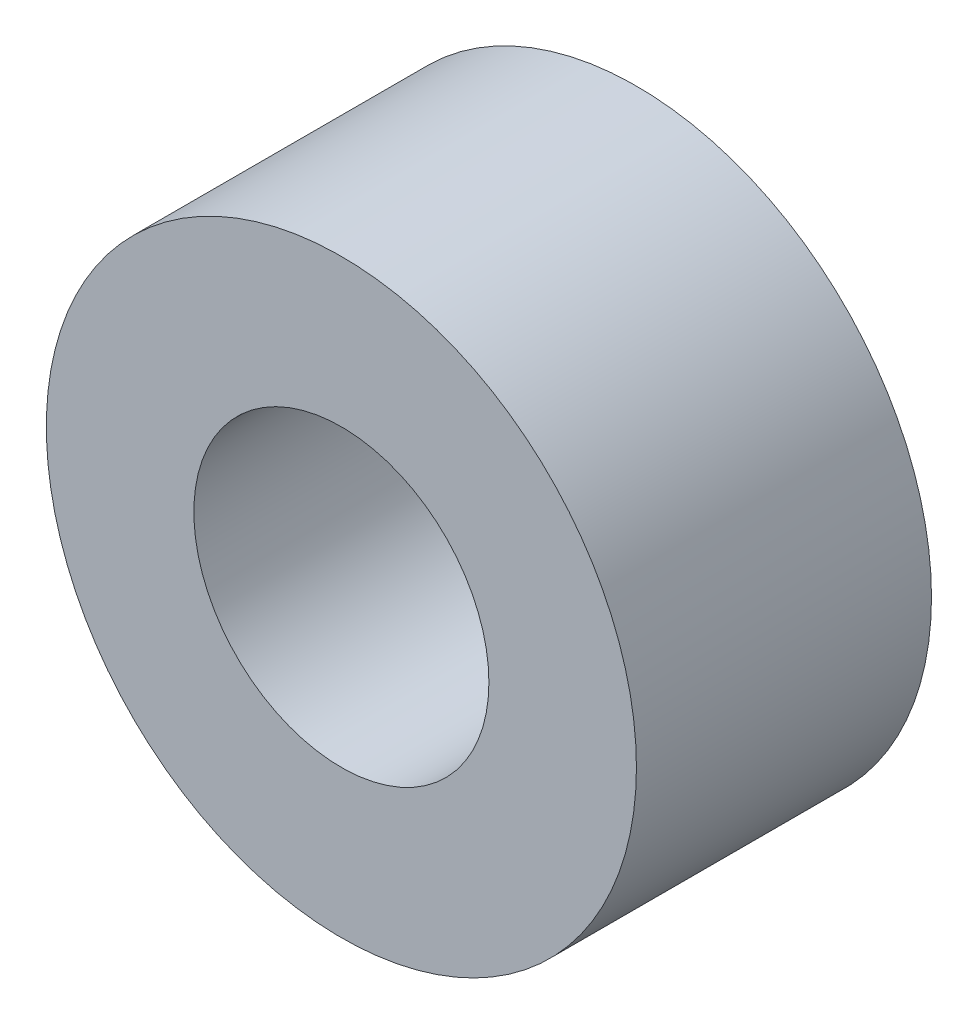
ISO-10303-21;
HEADER;
FILE_DESCRIPTION(('STEP AP214'),'2;1');
FILE_NAME('part.step','',(''),(''),'','','');
FILE_SCHEMA(('AUTOMOTIVE_DESIGN { 1 0 10303 214 1 1 1 1 }'));
ENDSEC;
DATA;
#1=APPLICATION_CONTEXT('core data for automotive mechanical design processes');
#2=APPLICATION_PROTOCOL_DEFINITION('international standard','automotive_design',2000,#1);
#3=PRODUCT_CONTEXT('',#1,'mechanical');
#4=PRODUCT('Part','Part','',(#3));
#5=PRODUCT_RELATED_PRODUCT_CATEGORY('part','',(#4));
#6=PRODUCT_DEFINITION_FORMATION('','',#4);
#7=PRODUCT_DEFINITION_CONTEXT('part definition',#1,'design');
#8=PRODUCT_DEFINITION('design','',#6,#7);
#9=PRODUCT_DEFINITION_SHAPE('','',#8);
#10=(LENGTH_UNIT() NAMED_UNIT(*) SI_UNIT(.MILLI.,.METRE.));
#11=(NAMED_UNIT(*) PLANE_ANGLE_UNIT() SI_UNIT($,.RADIAN.));
#12=(NAMED_UNIT(*) SI_UNIT($,.STERADIAN.) SOLID_ANGLE_UNIT());
#13=UNCERTAINTY_MEASURE_WITH_UNIT(LENGTH_MEASURE(1.E-05),#10,'distance_accuracy_value','');
#14=(GEOMETRIC_REPRESENTATION_CONTEXT(3) GLOBAL_UNCERTAINTY_ASSIGNED_CONTEXT((#13)) GLOBAL_UNIT_ASSIGNED_CONTEXT((#10,
#11,#12)) REPRESENTATION_CONTEXT('',''));
#15=CARTESIAN_POINT('',(0.,0.,0.));
#16=DIRECTION('',(0.,0.,1.));
#17=DIRECTION('',(1.,0.,0.));
#18=AXIS2_PLACEMENT_3D('',#15,#16,#17);
#19=CARTESIAN_POINT('',(0.,0.,10.));
#20=DIRECTION('',(0.,0.,1.));
#21=DIRECTION('',(1.,0.,0.));
#22=AXIS2_PLACEMENT_3D('',#19,#20,#21);
#23=PLANE('',#22);
#24=CARTESIAN_POINT('',(0.,0.,10.));
#25=DIRECTION('',(0.,0.,1.));
#26=DIRECTION('',(1.,0.,0.));
#27=AXIS2_PLACEMENT_3D('',#24,#25,#26);
#28=CIRCLE('',#27,10.);
#29=CARTESIAN_POINT('',(10.,0.,10.));
#30=VERTEX_POINT('',#29);
#31=EDGE_CURVE('E10',#30,#30,#28,.T.);
#32=ORIENTED_EDGE('',*,*,#31,.T.);
#33=EDGE_LOOP('',(#32));
#34=FACE_BOUND('',#33,.T.);
#35=CARTESIAN_POINT('',(0.,0.,10.));
#36=DIRECTION('',(0.,0.,1.));
#37=DIRECTION('',(1.,0.,0.));
#38=AXIS2_PLACEMENT_3D('',#35,#36,#37);
#39=CIRCLE('',#38,5.);
#40=CARTESIAN_POINT('',(5.,0.,10.));
#41=VERTEX_POINT('',#40);
#42=EDGE_CURVE('E44',#41,#41,#39,.T.);
#43=ORIENTED_EDGE('',*,*,#42,.F.);
#44=EDGE_LOOP('',(#43));
#45=FACE_BOUND('',#44,.T.);
#46=ADVANCED_FACE('F33',(#34,#45),#23,.T.);
#47=CARTESIAN_POINT('',(0.,0.,0.));
#48=DIRECTION('',(0.,0.,1.));
#49=DIRECTION('',(1.,0.,0.));
#50=AXIS2_PLACEMENT_3D('',#47,#48,#49);
#51=PLANE('',#50);
#52=CARTESIAN_POINT('',(0.,0.,0.));
#53=DIRECTION('',(0.,0.,1.));
#54=DIRECTION('',(1.,0.,0.));
#55=AXIS2_PLACEMENT_3D('',#52,#53,#54);
#56=CIRCLE('',#55,10.);
#57=CARTESIAN_POINT('',(10.,0.,0.));
#58=VERTEX_POINT('',#57);
#59=EDGE_CURVE('E37',#58,#58,#56,.T.);
#60=ORIENTED_EDGE('',*,*,#59,.F.);
#61=EDGE_LOOP('',(#60));
#62=FACE_BOUND('',#61,.T.);
#63=CARTESIAN_POINT('',(0.,0.,0.));
#64=DIRECTION('',(0.,0.,1.));
#65=DIRECTION('',(1.,0.,0.));
#66=AXIS2_PLACEMENT_3D('',#63,#64,#65);
#67=CIRCLE('',#66,5.);
#68=CARTESIAN_POINT('',(5.,0.,0.));
#69=VERTEX_POINT('',#68);
#70=EDGE_CURVE('E46',#69,#69,#67,.T.);
#71=ORIENTED_EDGE('',*,*,#70,.T.);
#72=EDGE_LOOP('',(#71));
#73=FACE_BOUND('',#72,.T.);
#74=ADVANCED_FACE('F56',(#62,#73),#51,.F.);
#75=CARTESIAN_POINT('',(0.,0.,10.));
#76=DIRECTION('',(0.,0.,-1.));
#77=DIRECTION('',(-1.,0.,0.));
#78=AXIS2_PLACEMENT_3D('',#75,#76,#77);
#79=CYLINDRICAL_SURFACE('',#78,10.);
#80=ORIENTED_EDGE('',*,*,#31,.F.);
#81=EDGE_LOOP('',(#80));
#82=FACE_BOUND('',#81,.T.);
#83=ORIENTED_EDGE('',*,*,#59,.T.);
#84=EDGE_LOOP('',(#83));
#85=FACE_BOUND('',#84,.T.);
#86=ADVANCED_FACE('F35',(#82,#85),#79,.T.);
#87=CARTESIAN_POINT('',(0.,0.,10.));
#88=DIRECTION('',(0.,0.,-1.));
#89=DIRECTION('',(-1.,0.,0.));
#90=AXIS2_PLACEMENT_3D('',#87,#88,#89);
#91=CYLINDRICAL_SURFACE('',#90,5.);
#92=ORIENTED_EDGE('',*,*,#42,.T.);
#93=EDGE_LOOP('',(#92));
#94=FACE_BOUND('',#93,.T.);
#95=ORIENTED_EDGE('',*,*,#70,.F.);
#96=EDGE_LOOP('',(#95));
#97=FACE_BOUND('',#96,.T.);
#98=ADVANCED_FACE('F52',(#94,#97),#91,.F.);
#99=CLOSED_SHELL('',(#46,#74,#86,#98));
#100=MANIFOLD_SOLID_BREP('B2',#99);
#101=ADVANCED_BREP_SHAPE_REPRESENTATION('',(#18,#100),#14);
#102=SHAPE_DEFINITION_REPRESENTATION(#9,#101);
ENDSEC;
END-ISO-10303-21;
